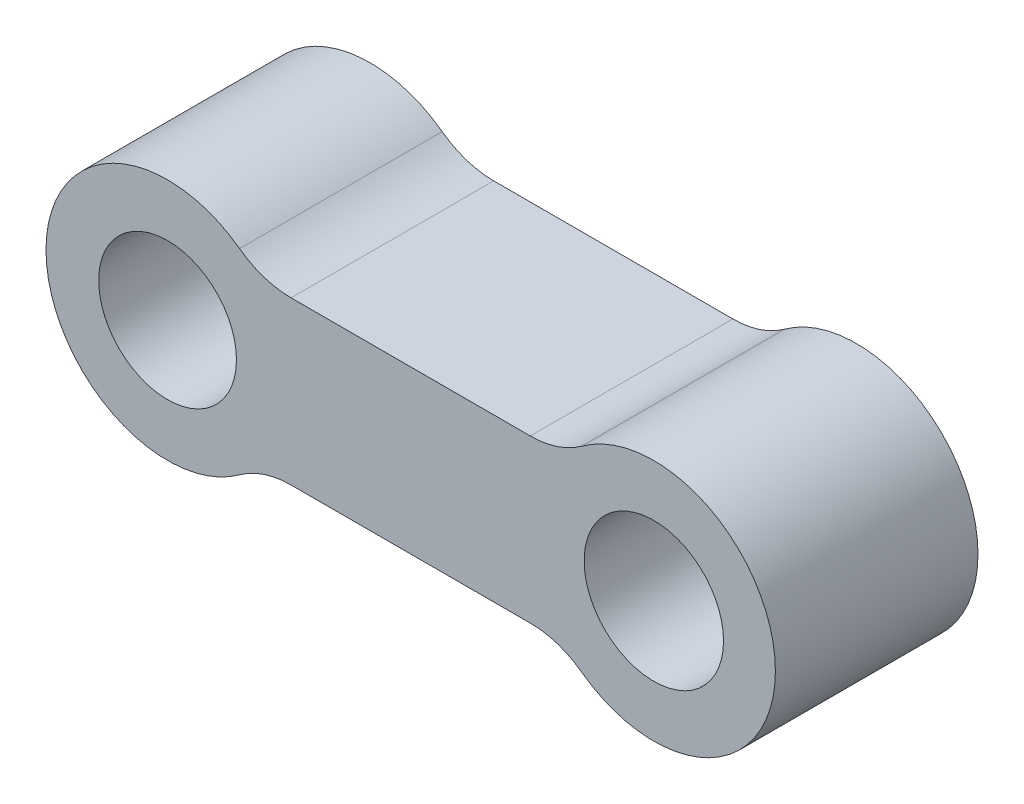
ISO-10303-21;
HEADER;
FILE_DESCRIPTION(('STEP AP214'),'2;1');
FILE_NAME('part.step','',(''),(''),'','','');
FILE_SCHEMA(('AUTOMOTIVE_DESIGN { 1 0 10303 214 1 1 1 1 }'));
ENDSEC;
DATA;
#1=APPLICATION_CONTEXT('core data for automotive mechanical design processes');
#2=APPLICATION_PROTOCOL_DEFINITION('international standard','automotive_design',2000,#1);
#3=PRODUCT_CONTEXT('',#1,'mechanical');
#4=PRODUCT('Part','Part','',(#3));
#5=PRODUCT_RELATED_PRODUCT_CATEGORY('part','',(#4));
#6=PRODUCT_DEFINITION_FORMATION('','',#4);
#7=PRODUCT_DEFINITION_CONTEXT('part definition',#1,'design');
#8=PRODUCT_DEFINITION('design','',#6,#7);
#9=PRODUCT_DEFINITION_SHAPE('','',#8);
#10=(LENGTH_UNIT() NAMED_UNIT(*) SI_UNIT(.MILLI.,.METRE.));
#11=(NAMED_UNIT(*) PLANE_ANGLE_UNIT() SI_UNIT($,.RADIAN.));
#12=(NAMED_UNIT(*) SI_UNIT($,.STERADIAN.) SOLID_ANGLE_UNIT());
#13=UNCERTAINTY_MEASURE_WITH_UNIT(LENGTH_MEASURE(1.E-05),#10,'distance_accuracy_value','');
#14=(GEOMETRIC_REPRESENTATION_CONTEXT(3) GLOBAL_UNCERTAINTY_ASSIGNED_CONTEXT((#13)) GLOBAL_UNIT_ASSIGNED_CONTEXT((#10,
#11,#12)) REPRESENTATION_CONTEXT('',''));
#15=CARTESIAN_POINT('',(0.,0.,0.));
#16=DIRECTION('',(0.,0.,1.));
#17=DIRECTION('',(1.,0.,0.));
#18=AXIS2_PLACEMENT_3D('',#15,#16,#17);
#19=CARTESIAN_POINT('',(-7.3776848355163,10.3699376933436,12.5));
#20=DIRECTION('',(0.,0.,1.));
#21=DIRECTION('',(1.,0.,0.));
#22=AXIS2_PLACEMENT_3D('',#19,#20,#21);
#23=PLANE('',#22);
#24=CARTESIAN_POINT('',(-15.,0.,12.5));
#25=DIRECTION('',(0.,0.,1.));
#26=DIRECTION('',(1.,0.,0.));
#27=AXIS2_PLACEMENT_3D('',#24,#25,#26);
#28=CIRCLE('',#27,4.25);
#29=CARTESIAN_POINT('',(-10.75,0.,12.5));
#30=VERTEX_POINT('',#29);
#31=EDGE_CURVE('E134',#30,#30,#28,.T.);
#32=ORIENTED_EDGE('',*,*,#31,.F.);
#33=EDGE_LOOP('',(#32));
#34=FACE_BOUND('',#33,.T.);
#35=CARTESIAN_POINT('',(-7.3776848355163,10.3699376933436,12.5));
#36=DIRECTION('',(0.,0.,-1.));
#37=DIRECTION('',(1.,0.,0.));
#38=AXIS2_PLACEMENT_3D('',#35,#36,#37);
#39=CIRCLE('',#38,5.36993769334362);
#40=CARTESIAN_POINT('',(-7.3776848355163,5.,12.5));
#41=VERTEX_POINT('',#40);
#42=CARTESIAN_POINT('',(-10.5580698915742,6.04311649001241,12.5));
#43=VERTEX_POINT('',#42);
#44=EDGE_CURVE('E145',#41,#43,#39,.T.);
#45=ORIENTED_EDGE('',*,*,#44,.T.);
#46=CARTESIAN_POINT('',(-15.,0.,12.5));
#47=DIRECTION('',(0.,0.,1.));
#48=DIRECTION('',(1.,0.,0.));
#49=AXIS2_PLACEMENT_3D('',#46,#47,#48);
#50=CIRCLE('',#49,7.5);
#51=CARTESIAN_POINT('',(-10.5580698915741,-6.04311649001241,12.5));
#52=VERTEX_POINT('',#51);
#53=EDGE_CURVE('E93',#43,#52,#50,.T.);
#54=ORIENTED_EDGE('',*,*,#53,.T.);
#55=CARTESIAN_POINT('',(-7.37768483551629,-10.3699376933436,12.5));
#56=DIRECTION('',(0.,0.,-1.));
#57=DIRECTION('',(-1.,0.,0.));
#58=AXIS2_PLACEMENT_3D('',#55,#56,#57);
#59=CIRCLE('',#58,5.36993769334362);
#60=CARTESIAN_POINT('',(-7.3776848355163,-5.,12.5));
#61=VERTEX_POINT('',#60);
#62=EDGE_CURVE('E160',#52,#61,#59,.T.);
#63=ORIENTED_EDGE('',*,*,#62,.T.);
#64=DIRECTION('',(1.,0.,0.));
#65=VECTOR('',#64,1.);
#66=CARTESIAN_POINT('',(-7.3776848355163,-5.,12.5));
#67=LINE('',#66,#65);
#68=CARTESIAN_POINT('',(7.3776848355163,-4.99999999999999,12.5));
#69=VERTEX_POINT('',#68);
#70=EDGE_CURVE('E173',#61,#69,#67,.T.);
#71=ORIENTED_EDGE('',*,*,#70,.T.);
#72=CARTESIAN_POINT('',(7.37768483551631,-10.3699376933436,12.5));
#73=DIRECTION('',(0.,0.,-1.));
#74=DIRECTION('',(1.,0.,0.));
#75=AXIS2_PLACEMENT_3D('',#72,#73,#74);
#76=CIRCLE('',#75,5.36993769334362);
#77=CARTESIAN_POINT('',(10.5580698915742,-6.0431164900124,12.5));
#78=VERTEX_POINT('',#77);
#79=EDGE_CURVE('E112',#69,#78,#76,.T.);
#80=ORIENTED_EDGE('',*,*,#79,.T.);
#81=CARTESIAN_POINT('',(15.,0.,12.5));
#82=DIRECTION('',(0.,0.,1.));
#83=DIRECTION('',(1.,0.,0.));
#84=AXIS2_PLACEMENT_3D('',#81,#82,#83);
#85=CIRCLE('',#84,7.5);
#86=CARTESIAN_POINT('',(10.5580698915742,6.04311649001242,12.5));
#87=VERTEX_POINT('',#86);
#88=EDGE_CURVE('E106',#78,#87,#85,.T.);
#89=ORIENTED_EDGE('',*,*,#88,.T.);
#90=CARTESIAN_POINT('',(7.3776848355163,10.3699376933436,12.5));
#91=DIRECTION('',(0.,0.,-1.));
#92=DIRECTION('',(-1.,0.,0.));
#93=AXIS2_PLACEMENT_3D('',#90,#91,#92);
#94=CIRCLE('',#93,5.36993769334362);
#95=CARTESIAN_POINT('',(7.3776848355163,5.,12.5));
#96=VERTEX_POINT('',#95);
#97=EDGE_CURVE('E110',#87,#96,#94,.T.);
#98=ORIENTED_EDGE('',*,*,#97,.T.);
#99=DIRECTION('',(-1.,0.,0.));
#100=VECTOR('',#99,1.);
#101=CARTESIAN_POINT('',(-7.3776848355163,5.,12.5));
#102=LINE('',#101,#100);
#103=EDGE_CURVE('E50',#96,#41,#102,.T.);
#104=ORIENTED_EDGE('',*,*,#103,.T.);
#105=EDGE_LOOP('',(#45,#54,#63,#71,#80,#89,#98,#104));
#106=FACE_BOUND('',#105,.T.);
#107=CARTESIAN_POINT('',(15.,0.,12.5));
#108=DIRECTION('',(0.,0.,1.));
#109=DIRECTION('',(1.,0.,0.));
#110=AXIS2_PLACEMENT_3D('',#107,#108,#109);
#111=CIRCLE('',#110,4.3);
#112=CARTESIAN_POINT('',(19.3,0.,12.5));
#113=VERTEX_POINT('',#112);
#114=EDGE_CURVE('E182',#113,#113,#111,.T.);
#115=ORIENTED_EDGE('',*,*,#114,.F.);
#116=EDGE_LOOP('',(#115));
#117=FACE_BOUND('',#116,.T.);
#118=ADVANCED_FACE('F33',(#34,#106,#117),#23,.T.);
#119=CARTESIAN_POINT('',(-7.3776848355163,10.3699376933436,0.));
#120=DIRECTION('',(0.,0.,1.));
#121=DIRECTION('',(1.,0.,0.));
#122=AXIS2_PLACEMENT_3D('',#119,#120,#121);
#123=PLANE('',#122);
#124=CARTESIAN_POINT('',(-7.3776848355163,10.3699376933436,0.));
#125=DIRECTION('',(0.,0.,-1.));
#126=DIRECTION('',(1.,0.,0.));
#127=AXIS2_PLACEMENT_3D('',#124,#125,#126);
#128=CIRCLE('',#127,5.36993769334362);
#129=CARTESIAN_POINT('',(-7.3776848355163,5.,0.));
#130=VERTEX_POINT('',#129);
#131=CARTESIAN_POINT('',(-10.5580698915742,6.04311649001241,0.));
#132=VERTEX_POINT('',#131);
#133=EDGE_CURVE('E130',#130,#132,#128,.T.);
#134=ORIENTED_EDGE('',*,*,#133,.F.);
#135=DIRECTION('',(-1.,0.,0.));
#136=VECTOR('',#135,1.);
#137=CARTESIAN_POINT('',(-7.3776848355163,5.,0.));
#138=LINE('',#137,#136);
#139=CARTESIAN_POINT('',(7.3776848355163,5.,0.));
#140=VERTEX_POINT('',#139);
#141=EDGE_CURVE('E85',#140,#130,#138,.T.);
#142=ORIENTED_EDGE('',*,*,#141,.F.);
#143=CARTESIAN_POINT('',(7.3776848355163,10.3699376933436,0.));
#144=DIRECTION('',(0.,0.,-1.));
#145=DIRECTION('',(-1.,0.,0.));
#146=AXIS2_PLACEMENT_3D('',#143,#144,#145);
#147=CIRCLE('',#146,5.36993769334362);
#148=CARTESIAN_POINT('',(10.5580698915742,6.04311649001242,0.));
#149=VERTEX_POINT('',#148);
#150=EDGE_CURVE('E79',#149,#140,#147,.T.);
#151=ORIENTED_EDGE('',*,*,#150,.F.);
#152=CARTESIAN_POINT('',(15.,0.,0.));
#153=DIRECTION('',(0.,0.,1.));
#154=DIRECTION('',(1.,0.,0.));
#155=AXIS2_PLACEMENT_3D('',#152,#153,#154);
#156=CIRCLE('',#155,7.5);
#157=CARTESIAN_POINT('',(10.5580698915742,-6.0431164900124,0.));
#158=VERTEX_POINT('',#157);
#159=EDGE_CURVE('E120',#158,#149,#156,.T.);
#160=ORIENTED_EDGE('',*,*,#159,.F.);
#161=CARTESIAN_POINT('',(7.37768483551631,-10.3699376933436,0.));
#162=DIRECTION('',(0.,0.,-1.));
#163=DIRECTION('',(1.,0.,0.));
#164=AXIS2_PLACEMENT_3D('',#161,#162,#163);
#165=CIRCLE('',#164,5.36993769334362);
#166=CARTESIAN_POINT('',(7.3776848355163,-4.99999999999999,0.));
#167=VERTEX_POINT('',#166);
#168=EDGE_CURVE('E140',#167,#158,#165,.T.);
#169=ORIENTED_EDGE('',*,*,#168,.F.);
#170=DIRECTION('',(1.,0.,0.));
#171=VECTOR('',#170,1.);
#172=CARTESIAN_POINT('',(-7.3776848355163,-5.,0.));
#173=LINE('',#172,#171);
#174=CARTESIAN_POINT('',(-7.3776848355163,-5.,0.));
#175=VERTEX_POINT('',#174);
#176=EDGE_CURVE('E138',#175,#167,#173,.T.);
#177=ORIENTED_EDGE('',*,*,#176,.F.);
#178=CARTESIAN_POINT('',(-7.37768483551629,-10.3699376933436,0.));
#179=DIRECTION('',(0.,0.,-1.));
#180=DIRECTION('',(-1.,0.,0.));
#181=AXIS2_PLACEMENT_3D('',#178,#179,#180);
#182=CIRCLE('',#181,5.36993769334362);
#183=CARTESIAN_POINT('',(-10.5580698915741,-6.04311649001241,0.));
#184=VERTEX_POINT('',#183);
#185=EDGE_CURVE('E136',#184,#175,#182,.T.);
#186=ORIENTED_EDGE('',*,*,#185,.F.);
#187=CARTESIAN_POINT('',(-15.,0.,0.));
#188=DIRECTION('',(0.,0.,1.));
#189=DIRECTION('',(1.,0.,0.));
#190=AXIS2_PLACEMENT_3D('',#187,#188,#189);
#191=CIRCLE('',#190,7.5);
#192=EDGE_CURVE('E133',#132,#184,#191,.T.);
#193=ORIENTED_EDGE('',*,*,#192,.F.);
#194=EDGE_LOOP('',(#134,#142,#151,#160,#169,#177,#186,#193));
#195=FACE_BOUND('',#194,.T.);
#196=CARTESIAN_POINT('',(-15.,0.,0.));
#197=DIRECTION('',(0.,0.,1.));
#198=DIRECTION('',(1.,0.,0.));
#199=AXIS2_PLACEMENT_3D('',#196,#197,#198);
#200=CIRCLE('',#199,4.25);
#201=CARTESIAN_POINT('',(-10.75,0.,0.));
#202=VERTEX_POINT('',#201);
#203=EDGE_CURVE('E179',#202,#202,#200,.T.);
#204=ORIENTED_EDGE('',*,*,#203,.T.);
#205=EDGE_LOOP('',(#204));
#206=FACE_BOUND('',#205,.T.);
#207=CARTESIAN_POINT('',(15.,0.,0.));
#208=DIRECTION('',(0.,0.,1.));
#209=DIRECTION('',(1.,0.,0.));
#210=AXIS2_PLACEMENT_3D('',#207,#208,#209);
#211=CIRCLE('',#210,4.3);
#212=CARTESIAN_POINT('',(19.3,0.,0.));
#213=VERTEX_POINT('',#212);
#214=EDGE_CURVE('E185',#213,#213,#211,.T.);
#215=ORIENTED_EDGE('',*,*,#214,.T.);
#216=EDGE_LOOP('',(#215));
#217=FACE_BOUND('',#216,.T.);
#218=ADVANCED_FACE('F164',(#195,#206,#217),#123,.F.);
#219=CARTESIAN_POINT('',(-7.3776848355163,10.3699376933436,12.5));
#220=DIRECTION('',(0.,0.,-1.));
#221=DIRECTION('',(-1.,0.,0.));
#222=AXIS2_PLACEMENT_3D('',#219,#220,#221);
#223=CYLINDRICAL_SURFACE('',#222,5.36993769334362);
#224=ORIENTED_EDGE('',*,*,#133,.T.);
#225=DIRECTION('',(0.,0.,-1.));
#226=VECTOR('',#225,1.);
#227=CARTESIAN_POINT('',(-10.5580698915742,6.04311649001241,12.5));
#228=LINE('',#227,#226);
#229=EDGE_CURVE('E11',#43,#132,#228,.T.);
#230=ORIENTED_EDGE('',*,*,#229,.F.);
#231=ORIENTED_EDGE('',*,*,#44,.F.);
#232=DIRECTION('',(0.,0.,-1.));
#233=VECTOR('',#232,1.);
#234=CARTESIAN_POINT('',(-7.3776848355163,5.,12.5));
#235=LINE('',#234,#233);
#236=EDGE_CURVE('E126',#41,#130,#235,.T.);
#237=ORIENTED_EDGE('',*,*,#236,.T.);
#238=EDGE_LOOP('',(#224,#230,#231,#237));
#239=FACE_BOUND('',#238,.T.);
#240=ADVANCED_FACE('F35',(#239),#223,.F.);
#241=CARTESIAN_POINT('',(-15.,0.,12.5));
#242=DIRECTION('',(0.,0.,-1.));
#243=DIRECTION('',(-1.,0.,0.));
#244=AXIS2_PLACEMENT_3D('',#241,#242,#243);
#245=CYLINDRICAL_SURFACE('',#244,7.5);
#246=ORIENTED_EDGE('',*,*,#192,.T.);
#247=DIRECTION('',(0.,0.,-1.));
#248=VECTOR('',#247,1.);
#249=CARTESIAN_POINT('',(-10.5580698915741,-6.04311649001241,12.5));
#250=LINE('',#249,#248);
#251=EDGE_CURVE('E42',#52,#184,#250,.T.);
#252=ORIENTED_EDGE('',*,*,#251,.F.);
#253=ORIENTED_EDGE('',*,*,#53,.F.);
#254=ORIENTED_EDGE('',*,*,#229,.T.);
#255=EDGE_LOOP('',(#246,#252,#253,#254));
#256=FACE_BOUND('',#255,.T.);
#257=ADVANCED_FACE('F217',(#256),#245,.T.);
#258=CARTESIAN_POINT('',(-7.37768483551629,-10.3699376933436,12.5));
#259=DIRECTION('',(0.,0.,-1.));
#260=DIRECTION('',(-1.,0.,0.));
#261=AXIS2_PLACEMENT_3D('',#258,#259,#260);
#262=CYLINDRICAL_SURFACE('',#261,5.36993769334362);
#263=ORIENTED_EDGE('',*,*,#185,.T.);
#264=DIRECTION('',(0.,0.,-1.));
#265=VECTOR('',#264,1.);
#266=CARTESIAN_POINT('',(-7.3776848355163,-5.,12.5));
#267=LINE('',#266,#265);
#268=EDGE_CURVE('E152',#61,#175,#267,.T.);
#269=ORIENTED_EDGE('',*,*,#268,.F.);
#270=ORIENTED_EDGE('',*,*,#62,.F.);
#271=ORIENTED_EDGE('',*,*,#251,.T.);
#272=EDGE_LOOP('',(#263,#269,#270,#271));
#273=FACE_BOUND('',#272,.T.);
#274=ADVANCED_FACE('F158',(#273),#262,.F.);
#275=CARTESIAN_POINT('',(-7.3776848355163,-5.,12.5));
#276=DIRECTION('',(0.,1.,0.));
#277=DIRECTION('',(-1.,0.,0.));
#278=AXIS2_PLACEMENT_3D('',#275,#276,#277);
#279=PLANE('',#278);
#280=ORIENTED_EDGE('',*,*,#176,.T.);
#281=DIRECTION('',(0.,0.,-1.));
#282=VECTOR('',#281,1.);
#283=CARTESIAN_POINT('',(7.3776848355163,-4.99999999999999,12.5));
#284=LINE('',#283,#282);
#285=EDGE_CURVE('E149',#69,#167,#284,.T.);
#286=ORIENTED_EDGE('',*,*,#285,.F.);
#287=ORIENTED_EDGE('',*,*,#70,.F.);
#288=ORIENTED_EDGE('',*,*,#268,.T.);
#289=EDGE_LOOP('',(#280,#286,#287,#288));
#290=FACE_BOUND('',#289,.T.);
#291=ADVANCED_FACE('F169',(#290),#279,.F.);
#292=CARTESIAN_POINT('',(7.37768483551631,-10.3699376933436,12.5));
#293=DIRECTION('',(0.,0.,-1.));
#294=DIRECTION('',(-1.,0.,0.));
#295=AXIS2_PLACEMENT_3D('',#292,#293,#294);
#296=CYLINDRICAL_SURFACE('',#295,5.36993769334362);
#297=ORIENTED_EDGE('',*,*,#168,.T.);
#298=DIRECTION('',(0.,0.,-1.));
#299=VECTOR('',#298,1.);
#300=CARTESIAN_POINT('',(10.5580698915742,-6.0431164900124,12.5));
#301=LINE('',#300,#299);
#302=EDGE_CURVE('E121',#78,#158,#301,.T.);
#303=ORIENTED_EDGE('',*,*,#302,.F.);
#304=ORIENTED_EDGE('',*,*,#79,.F.);
#305=ORIENTED_EDGE('',*,*,#285,.T.);
#306=EDGE_LOOP('',(#297,#303,#304,#305));
#307=FACE_BOUND('',#306,.T.);
#308=ADVANCED_FACE('F172',(#307),#296,.F.);
#309=CARTESIAN_POINT('',(15.,0.,12.5));
#310=DIRECTION('',(0.,0.,-1.));
#311=DIRECTION('',(-1.,0.,0.));
#312=AXIS2_PLACEMENT_3D('',#309,#310,#311);
#313=CYLINDRICAL_SURFACE('',#312,7.5);
#314=ORIENTED_EDGE('',*,*,#159,.T.);
#315=DIRECTION('',(0.,0.,-1.));
#316=VECTOR('',#315,1.);
#317=CARTESIAN_POINT('',(10.5580698915742,6.04311649001242,12.5));
#318=LINE('',#317,#316);
#319=EDGE_CURVE('E117',#87,#149,#318,.T.);
#320=ORIENTED_EDGE('',*,*,#319,.F.);
#321=ORIENTED_EDGE('',*,*,#88,.F.);
#322=ORIENTED_EDGE('',*,*,#302,.T.);
#323=EDGE_LOOP('',(#314,#320,#321,#322));
#324=FACE_BOUND('',#323,.T.);
#325=ADVANCED_FACE('F118',(#324),#313,.T.);
#326=CARTESIAN_POINT('',(7.3776848355163,10.3699376933436,12.5));
#327=DIRECTION('',(0.,0.,-1.));
#328=DIRECTION('',(-1.,0.,0.));
#329=AXIS2_PLACEMENT_3D('',#326,#327,#328);
#330=CYLINDRICAL_SURFACE('',#329,5.36993769334362);
#331=ORIENTED_EDGE('',*,*,#150,.T.);
#332=DIRECTION('',(0.,0.,-1.));
#333=VECTOR('',#332,1.);
#334=CARTESIAN_POINT('',(7.3776848355163,5.,12.5));
#335=LINE('',#334,#333);
#336=EDGE_CURVE('E122',#96,#140,#335,.T.);
#337=ORIENTED_EDGE('',*,*,#336,.F.);
#338=ORIENTED_EDGE('',*,*,#97,.F.);
#339=ORIENTED_EDGE('',*,*,#319,.T.);
#340=EDGE_LOOP('',(#331,#337,#338,#339));
#341=FACE_BOUND('',#340,.T.);
#342=ADVANCED_FACE('F124',(#341),#330,.F.);
#343=CARTESIAN_POINT('',(-7.3776848355163,5.,12.5));
#344=DIRECTION('',(0.,-1.,0.));
#345=DIRECTION('',(0.,0.,-1.));
#346=AXIS2_PLACEMENT_3D('',#343,#344,#345);
#347=PLANE('',#346);
#348=ORIENTED_EDGE('',*,*,#141,.T.);
#349=ORIENTED_EDGE('',*,*,#236,.F.);
#350=ORIENTED_EDGE('',*,*,#103,.F.);
#351=ORIENTED_EDGE('',*,*,#336,.T.);
#352=EDGE_LOOP('',(#348,#349,#350,#351));
#353=FACE_BOUND('',#352,.T.);
#354=ADVANCED_FACE('F205',(#353),#347,.F.);
#355=CARTESIAN_POINT('',(-15.,0.,12.5));
#356=DIRECTION('',(0.,0.,-1.));
#357=DIRECTION('',(-1.,0.,0.));
#358=AXIS2_PLACEMENT_3D('',#355,#356,#357);
#359=CYLINDRICAL_SURFACE('',#358,4.25);
#360=ORIENTED_EDGE('',*,*,#31,.T.);
#361=EDGE_LOOP('',(#360));
#362=FACE_BOUND('',#361,.T.);
#363=ORIENTED_EDGE('',*,*,#203,.F.);
#364=EDGE_LOOP('',(#363));
#365=FACE_BOUND('',#364,.T.);
#366=ADVANCED_FACE('F202',(#362,#365),#359,.F.);
#367=CARTESIAN_POINT('',(15.,0.,12.5));
#368=DIRECTION('',(0.,0.,-1.));
#369=DIRECTION('',(-1.,0.,0.));
#370=AXIS2_PLACEMENT_3D('',#367,#368,#369);
#371=CYLINDRICAL_SURFACE('',#370,4.3);
#372=ORIENTED_EDGE('',*,*,#114,.T.);
#373=EDGE_LOOP('',(#372));
#374=FACE_BOUND('',#373,.T.);
#375=ORIENTED_EDGE('',*,*,#214,.F.);
#376=EDGE_LOOP('',(#375));
#377=FACE_BOUND('',#376,.T.);
#378=ADVANCED_FACE('F191',(#374,#377),#371,.F.);
#379=CLOSED_SHELL('',(#118,#218,#240,#257,#274,#291,#308,#325,#342,#354,#366,#378));
#380=MANIFOLD_SOLID_BREP('B2',#379);
#381=ADVANCED_BREP_SHAPE_REPRESENTATION('',(#18,#380),#14);
#382=SHAPE_DEFINITION_REPRESENTATION(#9,#381);
ENDSEC;
END-ISO-10303-21;
